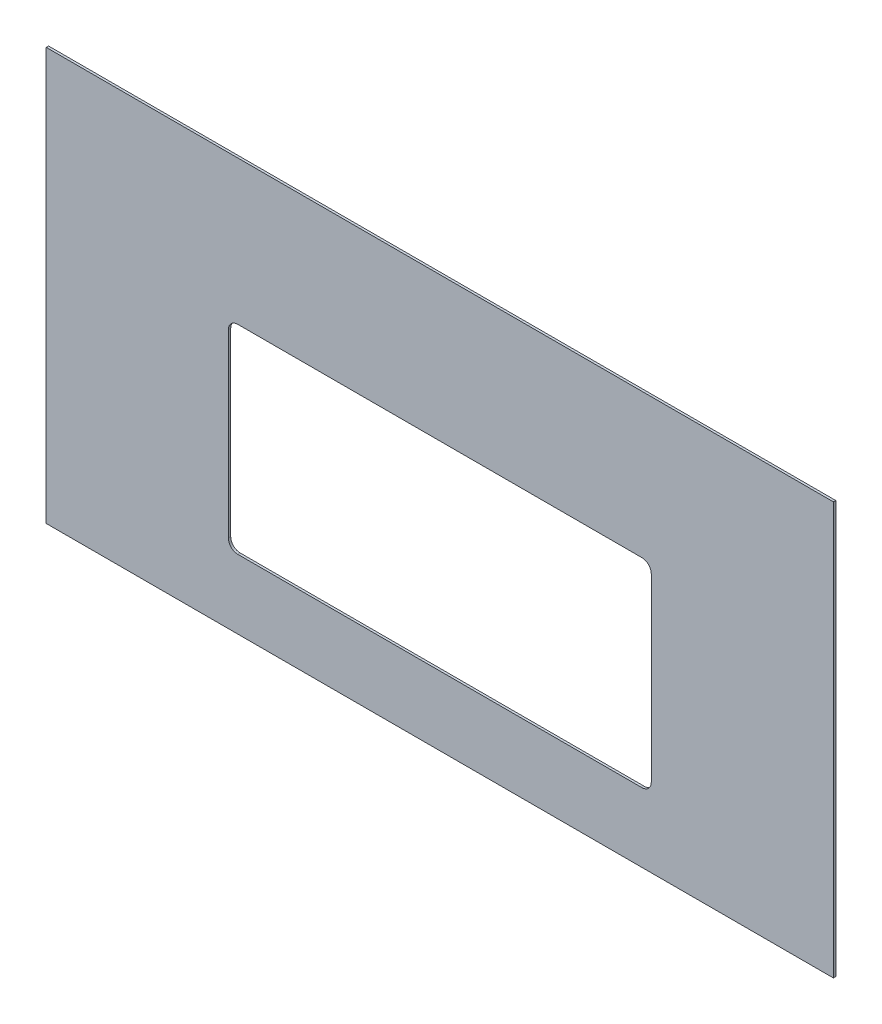
ISO-10303-21;
HEADER;
FILE_DESCRIPTION(('STEP AP214'),'2;1');
FILE_NAME('part.step','',(''),(''),'','','');
FILE_SCHEMA(('AUTOMOTIVE_DESIGN { 1 0 10303 214 1 1 1 1 }'));
ENDSEC;
DATA;
#1=APPLICATION_CONTEXT('core data for automotive mechanical design processes');
#2=APPLICATION_PROTOCOL_DEFINITION('international standard','automotive_design',2000,#1);
#3=PRODUCT_CONTEXT('',#1,'mechanical');
#4=PRODUCT('Part','Part','',(#3));
#5=PRODUCT_RELATED_PRODUCT_CATEGORY('part','',(#4));
#6=PRODUCT_DEFINITION_FORMATION('','',#4);
#7=PRODUCT_DEFINITION_CONTEXT('part definition',#1,'design');
#8=PRODUCT_DEFINITION('design','',#6,#7);
#9=PRODUCT_DEFINITION_SHAPE('','',#8);
#10=(LENGTH_UNIT() NAMED_UNIT(*) SI_UNIT(.MILLI.,.METRE.));
#11=(NAMED_UNIT(*) PLANE_ANGLE_UNIT() SI_UNIT($,.RADIAN.));
#12=(NAMED_UNIT(*) SI_UNIT($,.STERADIAN.) SOLID_ANGLE_UNIT());
#13=UNCERTAINTY_MEASURE_WITH_UNIT(LENGTH_MEASURE(1.E-05),#10,'distance_accuracy_value','');
#14=(GEOMETRIC_REPRESENTATION_CONTEXT(3) GLOBAL_UNCERTAINTY_ASSIGNED_CONTEXT((#13)) GLOBAL_UNIT_ASSIGNED_CONTEXT((#10,
#11,#12)) REPRESENTATION_CONTEXT('',''));
#15=CARTESIAN_POINT('',(0.,0.,0.));
#16=DIRECTION('',(0.,0.,1.));
#17=DIRECTION('',(1.,0.,0.));
#18=AXIS2_PLACEMENT_3D('',#15,#16,#17);
#19=CARTESIAN_POINT('',(533.4,279.4,3.175));
#20=DIRECTION('',(-1.,0.,0.));
#21=DIRECTION('',(0.,0.,1.));
#22=AXIS2_PLACEMENT_3D('',#19,#20,#21);
#23=PLANE('',#22);
#24=DIRECTION('',(0.,1.,0.));
#25=VECTOR('',#24,1.);
#26=CARTESIAN_POINT('',(533.4,279.4,0.));
#27=LINE('',#26,#25);
#28=CARTESIAN_POINT('',(533.4,-279.4,0.));
#29=VERTEX_POINT('',#28);
#30=CARTESIAN_POINT('',(533.4,279.4,0.));
#31=VERTEX_POINT('',#30);
#32=EDGE_CURVE('E135',#29,#31,#27,.T.);
#33=ORIENTED_EDGE('',*,*,#32,.T.);
#34=DIRECTION('',(0.,0.,-1.));
#35=VECTOR('',#34,1.);
#36=CARTESIAN_POINT('',(533.4,279.4,3.175));
#37=LINE('',#36,#35);
#38=CARTESIAN_POINT('',(533.4,279.4,3.175));
#39=VERTEX_POINT('',#38);
#40=EDGE_CURVE('E11',#39,#31,#37,.T.);
#41=ORIENTED_EDGE('',*,*,#40,.F.);
#42=DIRECTION('',(0.,1.,0.));
#43=VECTOR('',#42,1.);
#44=CARTESIAN_POINT('',(533.4,279.4,3.175));
#45=LINE('',#44,#43);
#46=CARTESIAN_POINT('',(533.4,-279.4,3.175));
#47=VERTEX_POINT('',#46);
#48=EDGE_CURVE('E180',#47,#39,#45,.T.);
#49=ORIENTED_EDGE('',*,*,#48,.F.);
#50=DIRECTION('',(0.,0.,-1.));
#51=VECTOR('',#50,1.);
#52=CARTESIAN_POINT('',(533.4,-279.4,3.175));
#53=LINE('',#52,#51);
#54=EDGE_CURVE('E190',#47,#29,#53,.T.);
#55=ORIENTED_EDGE('',*,*,#54,.T.);
#56=EDGE_LOOP('',(#33,#41,#49,#55));
#57=FACE_BOUND('',#56,.T.);
#58=ADVANCED_FACE('F33',(#57),#23,.F.);
#59=CARTESIAN_POINT('',(-533.4,279.4,3.175));
#60=DIRECTION('',(0.,-1.,0.));
#61=DIRECTION('',(0.,0.,-1.));
#62=AXIS2_PLACEMENT_3D('',#59,#60,#61);
#63=PLANE('',#62);
#64=DIRECTION('',(-1.,0.,0.));
#65=VECTOR('',#64,1.);
#66=CARTESIAN_POINT('',(-533.4,279.4,0.));
#67=LINE('',#66,#65);
#68=CARTESIAN_POINT('',(-533.4,279.4,0.));
#69=VERTEX_POINT('',#68);
#70=EDGE_CURVE('E193',#31,#69,#67,.T.);
#71=ORIENTED_EDGE('',*,*,#70,.T.);
#72=DIRECTION('',(0.,0.,-1.));
#73=VECTOR('',#72,1.);
#74=CARTESIAN_POINT('',(-533.4,279.4,3.175));
#75=LINE('',#74,#73);
#76=CARTESIAN_POINT('',(-533.4,279.4,3.175));
#77=VERTEX_POINT('',#76);
#78=EDGE_CURVE('E40',#77,#69,#75,.T.);
#79=ORIENTED_EDGE('',*,*,#78,.F.);
#80=DIRECTION('',(-1.,0.,0.));
#81=VECTOR('',#80,1.);
#82=CARTESIAN_POINT('',(-533.4,279.4,3.175));
#83=LINE('',#82,#81);
#84=EDGE_CURVE('E183',#39,#77,#83,.T.);
#85=ORIENTED_EDGE('',*,*,#84,.F.);
#86=ORIENTED_EDGE('',*,*,#40,.T.);
#87=EDGE_LOOP('',(#71,#79,#85,#86));
#88=FACE_BOUND('',#87,.T.);
#89=ADVANCED_FACE('F221',(#88),#63,.F.);
#90=CARTESIAN_POINT('',(-533.4,279.4,3.175));
#91=DIRECTION('',(1.,0.,0.));
#92=DIRECTION('',(0.,1.,0.));
#93=AXIS2_PLACEMENT_3D('',#90,#91,#92);
#94=PLANE('',#93);
#95=DIRECTION('',(0.,-1.,0.));
#96=VECTOR('',#95,1.);
#97=CARTESIAN_POINT('',(-533.4,279.4,0.));
#98=LINE('',#97,#96);
#99=CARTESIAN_POINT('',(-533.4,-279.4,0.));
#100=VERTEX_POINT('',#99);
#101=EDGE_CURVE('E195',#69,#100,#98,.T.);
#102=ORIENTED_EDGE('',*,*,#101,.T.);
#103=DIRECTION('',(0.,0.,-1.));
#104=VECTOR('',#103,1.);
#105=CARTESIAN_POINT('',(-533.4,-279.4,3.175));
#106=LINE('',#105,#104);
#107=CARTESIAN_POINT('',(-533.4,-279.4,3.175));
#108=VERTEX_POINT('',#107);
#109=EDGE_CURVE('E200',#108,#100,#106,.T.);
#110=ORIENTED_EDGE('',*,*,#109,.F.);
#111=DIRECTION('',(0.,-1.,0.));
#112=VECTOR('',#111,1.);
#113=CARTESIAN_POINT('',(-533.4,279.4,3.175));
#114=LINE('',#113,#112);
#115=EDGE_CURVE('E186',#77,#108,#114,.T.);
#116=ORIENTED_EDGE('',*,*,#115,.F.);
#117=ORIENTED_EDGE('',*,*,#78,.T.);
#118=EDGE_LOOP('',(#102,#110,#116,#117));
#119=FACE_BOUND('',#118,.T.);
#120=ADVANCED_FACE('F207',(#119),#94,.F.);
#121=CARTESIAN_POINT('',(-533.4,-279.4,3.175));
#122=DIRECTION('',(0.,1.,0.));
#123=DIRECTION('',(0.,0.,1.));
#124=AXIS2_PLACEMENT_3D('',#121,#122,#123);
#125=PLANE('',#124);
#126=DIRECTION('',(1.,0.,0.));
#127=VECTOR('',#126,1.);
#128=CARTESIAN_POINT('',(-533.4,-279.4,0.));
#129=LINE('',#128,#127);
#130=EDGE_CURVE('E184',#100,#29,#129,.T.);
#131=ORIENTED_EDGE('',*,*,#130,.T.);
#132=ORIENTED_EDGE('',*,*,#54,.F.);
#133=DIRECTION('',(1.,0.,0.));
#134=VECTOR('',#133,1.);
#135=CARTESIAN_POINT('',(-533.4,-279.4,3.175));
#136=LINE('',#135,#134);
#137=EDGE_CURVE('E188',#108,#47,#136,.T.);
#138=ORIENTED_EDGE('',*,*,#137,.F.);
#139=ORIENTED_EDGE('',*,*,#109,.T.);
#140=EDGE_LOOP('',(#131,#132,#138,#139));
#141=FACE_BOUND('',#140,.T.);
#142=ADVANCED_FACE('F214',(#141),#125,.F.);
#143=CARTESIAN_POINT('',(0.,0.,3.175));
#144=DIRECTION('',(0.,0.,1.));
#145=DIRECTION('',(1.,0.,0.));
#146=AXIS2_PLACEMENT_3D('',#143,#144,#145);
#147=PLANE('',#146);
#148=CARTESIAN_POINT('',(273.843749999999,71.4375000000001,3.175));
#149=DIRECTION('',(0.,0.,1.));
#150=DIRECTION('',(-1.,0.,0.));
#151=AXIS2_PLACEMENT_3D('',#148,#149,#150);
#152=CIRCLE('',#151,12.7);
#153=CARTESIAN_POINT('',(286.543749999999,71.4375,3.175));
#154=VERTEX_POINT('',#153);
#155=CARTESIAN_POINT('',(273.843749999999,84.1375000000001,3.175));
#156=VERTEX_POINT('',#155);
#157=EDGE_CURVE('E47',#154,#156,#152,.T.);
#158=ORIENTED_EDGE('',*,*,#157,.F.);
#159=DIRECTION('',(0.,1.,0.));
#160=VECTOR('',#159,1.);
#161=CARTESIAN_POINT('',(286.543749999999,71.4375,3.175));
#162=LINE('',#161,#160);
#163=CARTESIAN_POINT('',(286.54375,-173.0375,3.175));
#164=VERTEX_POINT('',#163);
#165=EDGE_CURVE('E129',#164,#154,#162,.T.);
#166=ORIENTED_EDGE('',*,*,#165,.F.);
#167=CARTESIAN_POINT('',(273.84375,-173.0375,3.175));
#168=DIRECTION('',(0.,0.,1.));
#169=DIRECTION('',(1.,0.,0.));
#170=AXIS2_PLACEMENT_3D('',#167,#168,#169);
#171=CIRCLE('',#170,12.7);
#172=CARTESIAN_POINT('',(273.843749999999,-185.7375,3.175));
#173=VERTEX_POINT('',#172);
#174=EDGE_CURVE('E163',#173,#164,#171,.T.);
#175=ORIENTED_EDGE('',*,*,#174,.F.);
#176=DIRECTION('',(1.,0.,0.));
#177=VECTOR('',#176,1.);
#178=CARTESIAN_POINT('',(-273.84375,-185.7375,3.175));
#179=LINE('',#178,#177);
#180=CARTESIAN_POINT('',(-273.84375,-185.7375,3.175));
#181=VERTEX_POINT('',#180);
#182=EDGE_CURVE('E160',#181,#173,#179,.T.);
#183=ORIENTED_EDGE('',*,*,#182,.F.);
#184=CARTESIAN_POINT('',(-273.84375,-173.0375,3.175));
#185=DIRECTION('',(0.,0.,1.));
#186=DIRECTION('',(1.,0.,0.));
#187=AXIS2_PLACEMENT_3D('',#184,#185,#186);
#188=CIRCLE('',#187,12.7);
#189=CARTESIAN_POINT('',(-286.54375,-173.0375,3.175));
#190=VERTEX_POINT('',#189);
#191=EDGE_CURVE('E157',#190,#181,#188,.T.);
#192=ORIENTED_EDGE('',*,*,#191,.F.);
#193=DIRECTION('',(0.,-1.,0.));
#194=VECTOR('',#193,1.);
#195=CARTESIAN_POINT('',(-286.543750000001,71.4375,3.175));
#196=LINE('',#195,#194);
#197=CARTESIAN_POINT('',(-286.543750000001,71.4375,3.175));
#198=VERTEX_POINT('',#197);
#199=EDGE_CURVE('E154',#198,#190,#196,.T.);
#200=ORIENTED_EDGE('',*,*,#199,.F.);
#201=CARTESIAN_POINT('',(-273.843750000001,71.4375000000001,3.175));
#202=DIRECTION('',(0.,0.,1.));
#203=DIRECTION('',(1.,0.,0.));
#204=AXIS2_PLACEMENT_3D('',#201,#202,#203);
#205=CIRCLE('',#204,12.7);
#206=CARTESIAN_POINT('',(-273.84375,84.1375000000001,3.175));
#207=VERTEX_POINT('',#206);
#208=EDGE_CURVE('E151',#207,#198,#205,.T.);
#209=ORIENTED_EDGE('',*,*,#208,.F.);
#210=DIRECTION('',(-1.,0.,0.));
#211=VECTOR('',#210,1.);
#212=CARTESIAN_POINT('',(-273.84375,84.1375000000001,3.175));
#213=LINE('',#212,#211);
#214=EDGE_CURVE('E144',#156,#207,#213,.T.);
#215=ORIENTED_EDGE('',*,*,#214,.F.);
#216=EDGE_LOOP('',(#158,#166,#175,#183,#192,#200,#209,#215));
#217=FACE_BOUND('',#216,.T.);
#218=ORIENTED_EDGE('',*,*,#48,.T.);
#219=ORIENTED_EDGE('',*,*,#84,.T.);
#220=ORIENTED_EDGE('',*,*,#115,.T.);
#221=ORIENTED_EDGE('',*,*,#137,.T.);
#222=EDGE_LOOP('',(#218,#219,#220,#221));
#223=FACE_BOUND('',#222,.T.);
#224=ADVANCED_FACE('F220',(#217,#223),#147,.T.);
#225=CARTESIAN_POINT('',(0.,0.,0.));
#226=DIRECTION('',(0.,0.,1.));
#227=DIRECTION('',(1.,0.,0.));
#228=AXIS2_PLACEMENT_3D('',#225,#226,#227);
#229=PLANE('',#228);
#230=DIRECTION('',(0.,-1.,0.));
#231=VECTOR('',#230,1.);
#232=CARTESIAN_POINT('',(286.543749999999,71.4375,0.));
#233=LINE('',#232,#231);
#234=CARTESIAN_POINT('',(286.543749999999,71.4375,0.));
#235=VERTEX_POINT('',#234);
#236=CARTESIAN_POINT('',(286.54375,-173.0375,0.));
#237=VERTEX_POINT('',#236);
#238=EDGE_CURVE('E142',#235,#237,#233,.T.);
#239=ORIENTED_EDGE('',*,*,#238,.F.);
#240=CARTESIAN_POINT('',(273.843749999999,71.4375000000001,0.));
#241=DIRECTION('',(0.,0.,1.));
#242=DIRECTION('',(1.,0.,0.));
#243=AXIS2_PLACEMENT_3D('',#240,#241,#242);
#244=CIRCLE('',#243,12.7);
#245=CARTESIAN_POINT('',(273.843749999999,84.1375000000001,0.));
#246=VERTEX_POINT('',#245);
#247=EDGE_CURVE('E123',#246,#235,#244,.F.);
#248=ORIENTED_EDGE('',*,*,#247,.F.);
#249=DIRECTION('',(1.,0.,0.));
#250=VECTOR('',#249,1.);
#251=CARTESIAN_POINT('',(-273.84375,84.1375000000001,0.));
#252=LINE('',#251,#250);
#253=CARTESIAN_POINT('',(-273.84375,84.1375000000001,0.));
#254=VERTEX_POINT('',#253);
#255=EDGE_CURVE('E132',#254,#246,#252,.T.);
#256=ORIENTED_EDGE('',*,*,#255,.F.);
#257=CARTESIAN_POINT('',(-273.843750000001,71.4375000000001,0.));
#258=DIRECTION('',(0.,0.,1.));
#259=DIRECTION('',(1.,0.,0.));
#260=AXIS2_PLACEMENT_3D('',#257,#258,#259);
#261=CIRCLE('',#260,12.7);
#262=CARTESIAN_POINT('',(-286.543750000001,71.4375,0.));
#263=VERTEX_POINT('',#262);
#264=EDGE_CURVE('E55',#263,#254,#261,.F.);
#265=ORIENTED_EDGE('',*,*,#264,.F.);
#266=DIRECTION('',(0.,1.,0.));
#267=VECTOR('',#266,1.);
#268=CARTESIAN_POINT('',(-286.543750000001,71.4375,0.));
#269=LINE('',#268,#267);
#270=CARTESIAN_POINT('',(-286.54375,-173.0375,0.));
#271=VERTEX_POINT('',#270);
#272=EDGE_CURVE('E274',#271,#263,#269,.T.);
#273=ORIENTED_EDGE('',*,*,#272,.F.);
#274=CARTESIAN_POINT('',(-273.84375,-173.0375,0.));
#275=DIRECTION('',(0.,0.,1.));
#276=DIRECTION('',(1.,0.,0.));
#277=AXIS2_PLACEMENT_3D('',#274,#275,#276);
#278=CIRCLE('',#277,12.7);
#279=CARTESIAN_POINT('',(-273.84375,-185.7375,0.));
#280=VERTEX_POINT('',#279);
#281=EDGE_CURVE('E269',#280,#271,#278,.F.);
#282=ORIENTED_EDGE('',*,*,#281,.F.);
#283=DIRECTION('',(-1.,0.,0.));
#284=VECTOR('',#283,1.);
#285=CARTESIAN_POINT('',(-273.84375,-185.7375,0.));
#286=LINE('',#285,#284);
#287=CARTESIAN_POINT('',(273.843749999999,-185.7375,0.));
#288=VERTEX_POINT('',#287);
#289=EDGE_CURVE('E268',#288,#280,#286,.T.);
#290=ORIENTED_EDGE('',*,*,#289,.F.);
#291=CARTESIAN_POINT('',(273.84375,-173.0375,0.));
#292=DIRECTION('',(0.,0.,1.));
#293=DIRECTION('',(1.,0.,0.));
#294=AXIS2_PLACEMENT_3D('',#291,#292,#293);
#295=CIRCLE('',#294,12.7);
#296=EDGE_CURVE('E146',#237,#288,#295,.F.);
#297=ORIENTED_EDGE('',*,*,#296,.F.);
#298=EDGE_LOOP('',(#239,#248,#256,#265,#273,#282,#290,#297));
#299=FACE_BOUND('',#298,.T.);
#300=ORIENTED_EDGE('',*,*,#32,.F.);
#301=ORIENTED_EDGE('',*,*,#130,.F.);
#302=ORIENTED_EDGE('',*,*,#101,.F.);
#303=ORIENTED_EDGE('',*,*,#70,.F.);
#304=EDGE_LOOP('',(#300,#301,#302,#303));
#305=FACE_BOUND('',#304,.T.);
#306=ADVANCED_FACE('F138',(#299,#305),#229,.F.);
#307=CARTESIAN_POINT('',(273.843749999999,71.4375000000001,-0.00100000000000013));
#308=DIRECTION('',(0.,0.,1.));
#309=DIRECTION('',(1.,0.,0.));
#310=AXIS2_PLACEMENT_3D('',#307,#308,#309);
#311=CYLINDRICAL_SURFACE('',#310,12.7);
#312=ORIENTED_EDGE('',*,*,#247,.T.);
#313=DIRECTION('',(0.,0.,1.));
#314=VECTOR('',#313,1.);
#315=CARTESIAN_POINT('',(286.543749999999,71.4375,-0.00100000000000013));
#316=LINE('',#315,#314);
#317=EDGE_CURVE('E136',#235,#154,#316,.T.);
#318=ORIENTED_EDGE('',*,*,#317,.T.);
#319=ORIENTED_EDGE('',*,*,#157,.T.);
#320=DIRECTION('',(0.,0.,1.));
#321=VECTOR('',#320,1.);
#322=CARTESIAN_POINT('',(273.843749999999,84.1375000000001,-0.00100000000000013));
#323=LINE('',#322,#321);
#324=EDGE_CURVE('E119',#246,#156,#323,.T.);
#325=ORIENTED_EDGE('',*,*,#324,.F.);
#326=EDGE_LOOP('',(#312,#318,#319,#325));
#327=FACE_BOUND('',#326,.T.);
#328=ADVANCED_FACE('F121',(#327),#311,.F.);
#329=CARTESIAN_POINT('',(286.543749999999,71.4375,-0.00100000000000013));
#330=DIRECTION('',(1.,0.,0.));
#331=DIRECTION('',(0.,1.,0.));
#332=AXIS2_PLACEMENT_3D('',#329,#330,#331);
#333=PLANE('',#332);
#334=ORIENTED_EDGE('',*,*,#238,.T.);
#335=DIRECTION('',(0.,0.,1.));
#336=VECTOR('',#335,1.);
#337=CARTESIAN_POINT('',(286.54375,-173.0375,-0.00100000000000013));
#338=LINE('',#337,#336);
#339=EDGE_CURVE('E169',#237,#164,#338,.T.);
#340=ORIENTED_EDGE('',*,*,#339,.T.);
#341=ORIENTED_EDGE('',*,*,#165,.T.);
#342=ORIENTED_EDGE('',*,*,#317,.F.);
#343=EDGE_LOOP('',(#334,#340,#341,#342));
#344=FACE_BOUND('',#343,.T.);
#345=ADVANCED_FACE('F238',(#344),#333,.F.);
#346=CARTESIAN_POINT('',(273.84375,-173.0375,-0.00100000000000013));
#347=DIRECTION('',(0.,0.,1.));
#348=DIRECTION('',(1.,0.,0.));
#349=AXIS2_PLACEMENT_3D('',#346,#347,#348);
#350=CYLINDRICAL_SURFACE('',#349,12.7);
#351=ORIENTED_EDGE('',*,*,#296,.T.);
#352=DIRECTION('',(0.,0.,1.));
#353=VECTOR('',#352,1.);
#354=CARTESIAN_POINT('',(273.843749999999,-185.7375,-0.00100000000000013));
#355=LINE('',#354,#353);
#356=EDGE_CURVE('E171',#288,#173,#355,.T.);
#357=ORIENTED_EDGE('',*,*,#356,.T.);
#358=ORIENTED_EDGE('',*,*,#174,.T.);
#359=ORIENTED_EDGE('',*,*,#339,.F.);
#360=EDGE_LOOP('',(#351,#357,#358,#359));
#361=FACE_BOUND('',#360,.T.);
#362=ADVANCED_FACE('F255',(#361),#350,.F.);
#363=CARTESIAN_POINT('',(-273.84375,-185.7375,-0.00100000000000013));
#364=DIRECTION('',(0.,-1.,0.));
#365=DIRECTION('',(0.,0.,-1.));
#366=AXIS2_PLACEMENT_3D('',#363,#364,#365);
#367=PLANE('',#366);
#368=ORIENTED_EDGE('',*,*,#289,.T.);
#369=DIRECTION('',(0.,0.,1.));
#370=VECTOR('',#369,1.);
#371=CARTESIAN_POINT('',(-273.84375,-185.7375,-0.00100000000000013));
#372=LINE('',#371,#370);
#373=EDGE_CURVE('E173',#280,#181,#372,.T.);
#374=ORIENTED_EDGE('',*,*,#373,.T.);
#375=ORIENTED_EDGE('',*,*,#182,.T.);
#376=ORIENTED_EDGE('',*,*,#356,.F.);
#377=EDGE_LOOP('',(#368,#374,#375,#376));
#378=FACE_BOUND('',#377,.T.);
#379=ADVANCED_FACE('F251',(#378),#367,.F.);
#380=CARTESIAN_POINT('',(-273.84375,-173.0375,-0.00100000000000013));
#381=DIRECTION('',(0.,0.,1.));
#382=DIRECTION('',(1.,0.,0.));
#383=AXIS2_PLACEMENT_3D('',#380,#381,#382);
#384=CYLINDRICAL_SURFACE('',#383,12.7);
#385=ORIENTED_EDGE('',*,*,#281,.T.);
#386=DIRECTION('',(0.,0.,1.));
#387=VECTOR('',#386,1.);
#388=CARTESIAN_POINT('',(-286.54375,-173.0375,-0.00100000000000013));
#389=LINE('',#388,#387);
#390=EDGE_CURVE('E175',#271,#190,#389,.T.);
#391=ORIENTED_EDGE('',*,*,#390,.T.);
#392=ORIENTED_EDGE('',*,*,#191,.T.);
#393=ORIENTED_EDGE('',*,*,#373,.F.);
#394=EDGE_LOOP('',(#385,#391,#392,#393));
#395=FACE_BOUND('',#394,.T.);
#396=ADVANCED_FACE('F247',(#395),#384,.F.);
#397=CARTESIAN_POINT('',(-286.543750000001,71.4375,-0.00100000000000013));
#398=DIRECTION('',(-1.,0.,0.));
#399=DIRECTION('',(0.,-1.,0.));
#400=AXIS2_PLACEMENT_3D('',#397,#398,#399);
#401=PLANE('',#400);
#402=ORIENTED_EDGE('',*,*,#272,.T.);
#403=DIRECTION('',(0.,0.,1.));
#404=VECTOR('',#403,1.);
#405=CARTESIAN_POINT('',(-286.543750000001,71.4375,-0.00100000000000013));
#406=LINE('',#405,#404);
#407=EDGE_CURVE('E177',#263,#198,#406,.T.);
#408=ORIENTED_EDGE('',*,*,#407,.T.);
#409=ORIENTED_EDGE('',*,*,#199,.T.);
#410=ORIENTED_EDGE('',*,*,#390,.F.);
#411=EDGE_LOOP('',(#402,#408,#409,#410));
#412=FACE_BOUND('',#411,.T.);
#413=ADVANCED_FACE('F244',(#412),#401,.F.);
#414=CARTESIAN_POINT('',(-273.843750000001,71.4375000000001,-0.00100000000000013));
#415=DIRECTION('',(0.,0.,1.));
#416=DIRECTION('',(1.,0.,0.));
#417=AXIS2_PLACEMENT_3D('',#414,#415,#416);
#418=CYLINDRICAL_SURFACE('',#417,12.7);
#419=ORIENTED_EDGE('',*,*,#264,.T.);
#420=DIRECTION('',(0.,0.,1.));
#421=VECTOR('',#420,1.);
#422=CARTESIAN_POINT('',(-273.84375,84.1375000000001,-0.00100000000000013));
#423=LINE('',#422,#421);
#424=EDGE_CURVE('E128',#254,#207,#423,.T.);
#425=ORIENTED_EDGE('',*,*,#424,.T.);
#426=ORIENTED_EDGE('',*,*,#208,.T.);
#427=ORIENTED_EDGE('',*,*,#407,.F.);
#428=EDGE_LOOP('',(#419,#425,#426,#427));
#429=FACE_BOUND('',#428,.T.);
#430=ADVANCED_FACE('F241',(#429),#418,.F.);
#431=CARTESIAN_POINT('',(-273.84375,84.1375000000001,-0.00100000000000013));
#432=DIRECTION('',(0.,1.,0.));
#433=DIRECTION('',(0.,0.,1.));
#434=AXIS2_PLACEMENT_3D('',#431,#432,#433);
#435=PLANE('',#434);
#436=ORIENTED_EDGE('',*,*,#255,.T.);
#437=ORIENTED_EDGE('',*,*,#324,.T.);
#438=ORIENTED_EDGE('',*,*,#214,.T.);
#439=ORIENTED_EDGE('',*,*,#424,.F.);
#440=EDGE_LOOP('',(#436,#437,#438,#439));
#441=FACE_BOUND('',#440,.T.);
#442=ADVANCED_FACE('F133',(#441),#435,.F.);
#443=CLOSED_SHELL('',(#58,#89,#120,#142,#224,#306,#328,#345,#362,#379,#396,#413,#430,#442));
#444=MANIFOLD_SOLID_BREP('B2',#443);
#445=ADVANCED_BREP_SHAPE_REPRESENTATION('',(#18,#444),#14);
#446=SHAPE_DEFINITION_REPRESENTATION(#9,#445);
ENDSEC;
END-ISO-10303-21;
